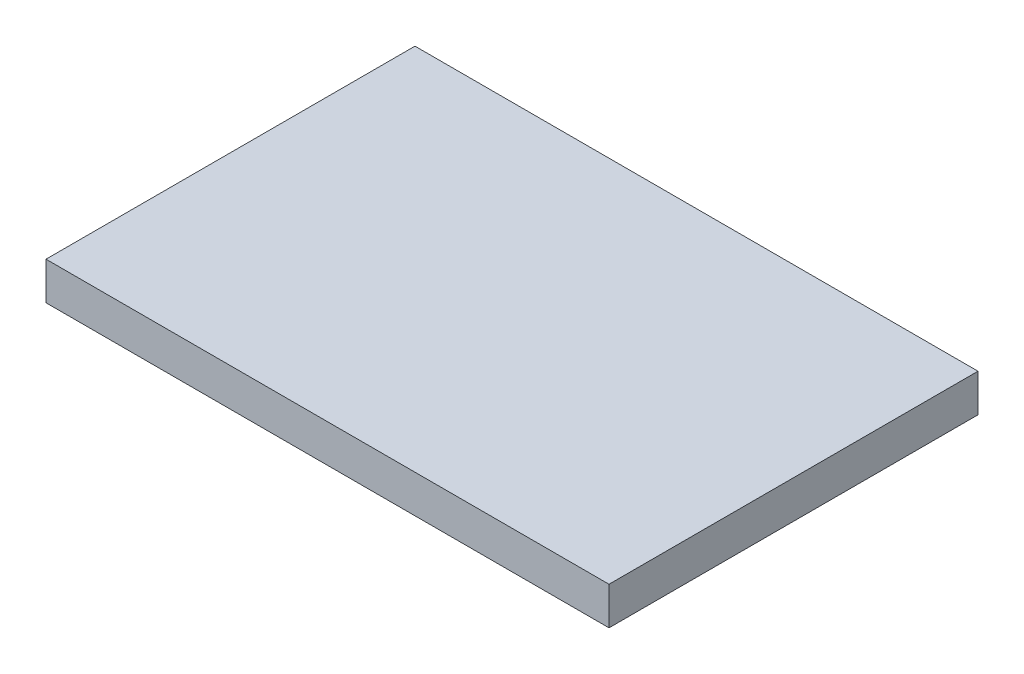
ISO-10303-21;
HEADER;
FILE_DESCRIPTION(('STEP AP214'),'2;1');
FILE_NAME('part.step','',(''),(''),'','','');
FILE_SCHEMA(('AUTOMOTIVE_DESIGN { 1 0 10303 214 1 1 1 1 }'));
ENDSEC;
DATA;
#1=APPLICATION_CONTEXT('core data for automotive mechanical design processes');
#2=APPLICATION_PROTOCOL_DEFINITION('international standard','automotive_design',2000,#1);
#3=PRODUCT_CONTEXT('',#1,'mechanical');
#4=PRODUCT('Part','Part','',(#3));
#5=PRODUCT_RELATED_PRODUCT_CATEGORY('part','',(#4));
#6=PRODUCT_DEFINITION_FORMATION('','',#4);
#7=PRODUCT_DEFINITION_CONTEXT('part definition',#1,'design');
#8=PRODUCT_DEFINITION('design','',#6,#7);
#9=PRODUCT_DEFINITION_SHAPE('','',#8);
#10=(LENGTH_UNIT() NAMED_UNIT(*) SI_UNIT(.MILLI.,.METRE.));
#11=(NAMED_UNIT(*) PLANE_ANGLE_UNIT() SI_UNIT($,.RADIAN.));
#12=(NAMED_UNIT(*) SI_UNIT($,.STERADIAN.) SOLID_ANGLE_UNIT());
#13=UNCERTAINTY_MEASURE_WITH_UNIT(LENGTH_MEASURE(1.E-05),#10,'distance_accuracy_value','');
#14=(GEOMETRIC_REPRESENTATION_CONTEXT(3) GLOBAL_UNCERTAINTY_ASSIGNED_CONTEXT((#13)) GLOBAL_UNIT_ASSIGNED_CONTEXT((#10,
#11,#12)) REPRESENTATION_CONTEXT('',''));
#15=CARTESIAN_POINT('',(0.,0.,0.));
#16=DIRECTION('',(0.,0.,1.));
#17=DIRECTION('',(1.,0.,0.));
#18=AXIS2_PLACEMENT_3D('',#15,#16,#17);
#19=CARTESIAN_POINT('',(7.675,1.03,-5.03));
#20=DIRECTION('',(-1.,0.,0.));
#21=DIRECTION('',(0.,0.,1.));
#22=AXIS2_PLACEMENT_3D('',#19,#20,#21);
#23=PLANE('',#22);
#24=DIRECTION('',(0.,0.,-1.));
#25=VECTOR('',#24,1.);
#26=CARTESIAN_POINT('',(7.675,0.,-5.03));
#27=LINE('',#26,#25);
#28=CARTESIAN_POINT('',(7.675,0.,5.03));
#29=VERTEX_POINT('',#28);
#30=CARTESIAN_POINT('',(7.675,0.,-5.03));
#31=VERTEX_POINT('',#30);
#32=EDGE_CURVE('E109',#29,#31,#27,.T.);
#33=ORIENTED_EDGE('',*,*,#32,.T.);
#34=DIRECTION('',(0.,-1.,0.));
#35=VECTOR('',#34,1.);
#36=CARTESIAN_POINT('',(7.675,1.03,-5.03));
#37=LINE('',#36,#35);
#38=CARTESIAN_POINT('',(7.675,1.03,-5.03));
#39=VERTEX_POINT('',#38);
#40=EDGE_CURVE('E11',#39,#31,#37,.T.);
#41=ORIENTED_EDGE('',*,*,#40,.F.);
#42=DIRECTION('',(0.,0.,-1.));
#43=VECTOR('',#42,1.);
#44=CARTESIAN_POINT('',(7.675,1.03,-5.03));
#45=LINE('',#44,#43);
#46=CARTESIAN_POINT('',(7.675,1.03,5.03));
#47=VERTEX_POINT('',#46);
#48=EDGE_CURVE('E93',#47,#39,#45,.T.);
#49=ORIENTED_EDGE('',*,*,#48,.F.);
#50=DIRECTION('',(0.,-1.,0.));
#51=VECTOR('',#50,1.);
#52=CARTESIAN_POINT('',(7.675,1.03,5.03));
#53=LINE('',#52,#51);
#54=EDGE_CURVE('E105',#47,#29,#53,.T.);
#55=ORIENTED_EDGE('',*,*,#54,.T.);
#56=EDGE_LOOP('',(#33,#41,#49,#55));
#57=FACE_BOUND('',#56,.T.);
#58=ADVANCED_FACE('F41',(#57),#23,.F.);
#59=CARTESIAN_POINT('',(-7.675,1.03,-5.03));
#60=DIRECTION('',(0.,0.,1.));
#61=DIRECTION('',(1.,0.,0.));
#62=AXIS2_PLACEMENT_3D('',#59,#60,#61);
#63=PLANE('',#62);
#64=DIRECTION('',(-1.,0.,0.));
#65=VECTOR('',#64,1.);
#66=CARTESIAN_POINT('',(-7.675,0.,-5.03));
#67=LINE('',#66,#65);
#68=CARTESIAN_POINT('',(-7.675,0.,-5.03));
#69=VERTEX_POINT('',#68);
#70=EDGE_CURVE('E98',#31,#69,#67,.T.);
#71=ORIENTED_EDGE('',*,*,#70,.T.);
#72=DIRECTION('',(0.,-1.,0.));
#73=VECTOR('',#72,1.);
#74=CARTESIAN_POINT('',(-7.675,1.03,-5.03));
#75=LINE('',#74,#73);
#76=CARTESIAN_POINT('',(-7.675,1.03,-5.03));
#77=VERTEX_POINT('',#76);
#78=EDGE_CURVE('E50',#77,#69,#75,.T.);
#79=ORIENTED_EDGE('',*,*,#78,.F.);
#80=DIRECTION('',(-1.,0.,0.));
#81=VECTOR('',#80,1.);
#82=CARTESIAN_POINT('',(-7.675,1.03,-5.03));
#83=LINE('',#82,#81);
#84=EDGE_CURVE('E88',#39,#77,#83,.T.);
#85=ORIENTED_EDGE('',*,*,#84,.F.);
#86=ORIENTED_EDGE('',*,*,#40,.T.);
#87=EDGE_LOOP('',(#71,#79,#85,#86));
#88=FACE_BOUND('',#87,.T.);
#89=ADVANCED_FACE('F97',(#88),#63,.F.);
#90=CARTESIAN_POINT('',(-7.675,1.03,-5.03));
#91=DIRECTION('',(1.,0.,0.));
#92=DIRECTION('',(0.,0.,-1.));
#93=AXIS2_PLACEMENT_3D('',#90,#91,#92);
#94=PLANE('',#93);
#95=DIRECTION('',(0.,0.,1.));
#96=VECTOR('',#95,1.);
#97=CARTESIAN_POINT('',(-7.675,0.,-5.03));
#98=LINE('',#97,#96);
#99=CARTESIAN_POINT('',(-7.675,0.,5.03));
#100=VERTEX_POINT('',#99);
#101=EDGE_CURVE('E75',#69,#100,#98,.T.);
#102=ORIENTED_EDGE('',*,*,#101,.T.);
#103=DIRECTION('',(0.,-1.,0.));
#104=VECTOR('',#103,1.);
#105=CARTESIAN_POINT('',(-7.675,1.03,5.03));
#106=LINE('',#105,#104);
#107=CARTESIAN_POINT('',(-7.675,1.03,5.03));
#108=VERTEX_POINT('',#107);
#109=EDGE_CURVE('E100',#108,#100,#106,.T.);
#110=ORIENTED_EDGE('',*,*,#109,.F.);
#111=DIRECTION('',(0.,0.,1.));
#112=VECTOR('',#111,1.);
#113=CARTESIAN_POINT('',(-7.675,1.03,-5.03));
#114=LINE('',#113,#112);
#115=EDGE_CURVE('E91',#77,#108,#114,.T.);
#116=ORIENTED_EDGE('',*,*,#115,.F.);
#117=ORIENTED_EDGE('',*,*,#78,.T.);
#118=EDGE_LOOP('',(#102,#110,#116,#117));
#119=FACE_BOUND('',#118,.T.);
#120=ADVANCED_FACE('F101',(#119),#94,.F.);
#121=CARTESIAN_POINT('',(-7.675,1.03,5.03));
#122=DIRECTION('',(0.,0.,-1.));
#123=DIRECTION('',(-1.,0.,0.));
#124=AXIS2_PLACEMENT_3D('',#121,#122,#123);
#125=PLANE('',#124);
#126=DIRECTION('',(1.,0.,0.));
#127=VECTOR('',#126,1.);
#128=CARTESIAN_POINT('',(-7.675,0.,5.03));
#129=LINE('',#128,#127);
#130=EDGE_CURVE('E81',#100,#29,#129,.T.);
#131=ORIENTED_EDGE('',*,*,#130,.T.);
#132=ORIENTED_EDGE('',*,*,#54,.F.);
#133=DIRECTION('',(1.,0.,0.));
#134=VECTOR('',#133,1.);
#135=CARTESIAN_POINT('',(-7.675,1.03,5.03));
#136=LINE('',#135,#134);
#137=EDGE_CURVE('E58',#108,#47,#136,.T.);
#138=ORIENTED_EDGE('',*,*,#137,.F.);
#139=ORIENTED_EDGE('',*,*,#109,.T.);
#140=EDGE_LOOP('',(#131,#132,#138,#139));
#141=FACE_BOUND('',#140,.T.);
#142=ADVANCED_FACE('F122',(#141),#125,.F.);
#143=CARTESIAN_POINT('',(0.,1.03,0.));
#144=DIRECTION('',(0.,1.,0.));
#145=DIRECTION('',(0.,0.,1.));
#146=AXIS2_PLACEMENT_3D('',#143,#144,#145);
#147=PLANE('',#146);
#148=ORIENTED_EDGE('',*,*,#48,.T.);
#149=ORIENTED_EDGE('',*,*,#84,.T.);
#150=ORIENTED_EDGE('',*,*,#115,.T.);
#151=ORIENTED_EDGE('',*,*,#137,.T.);
#152=EDGE_LOOP('',(#148,#149,#150,#151));
#153=FACE_BOUND('',#152,.T.);
#154=ADVANCED_FACE('F89',(#153),#147,.T.);
#155=CARTESIAN_POINT('',(0.,0.,0.));
#156=DIRECTION('',(0.,1.,0.));
#157=DIRECTION('',(0.,0.,1.));
#158=AXIS2_PLACEMENT_3D('',#155,#156,#157);
#159=PLANE('',#158);
#160=ORIENTED_EDGE('',*,*,#32,.F.);
#161=ORIENTED_EDGE('',*,*,#130,.F.);
#162=ORIENTED_EDGE('',*,*,#101,.F.);
#163=ORIENTED_EDGE('',*,*,#70,.F.);
#164=EDGE_LOOP('',(#160,#161,#162,#163));
#165=FACE_BOUND('',#164,.T.);
#166=ADVANCED_FACE('F125',(#165),#159,.F.);
#167=CLOSED_SHELL('',(#58,#89,#120,#142,#154,#166));
#168=MANIFOLD_SOLID_BREP('B2',#167);
#169=ADVANCED_BREP_SHAPE_REPRESENTATION('',(#18,#168),#14);
#170=SHAPE_DEFINITION_REPRESENTATION(#9,#169);
ENDSEC;
END-ISO-10303-21;
